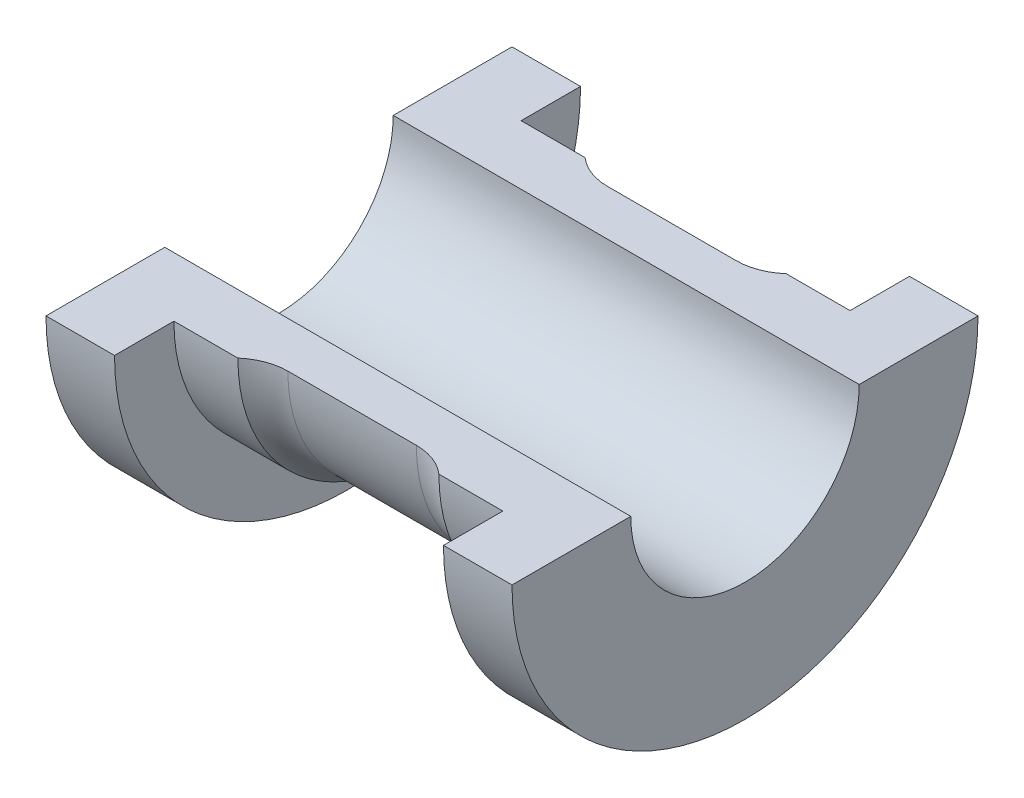
ISO-10303-21;
HEADER;
FILE_DESCRIPTION(('STEP AP214'),'2;1');
FILE_NAME('part.step','',(''),(''),'','','');
FILE_SCHEMA(('AUTOMOTIVE_DESIGN { 1 0 10303 214 1 1 1 1 }'));
ENDSEC;
DATA;
#1=APPLICATION_CONTEXT('core data for automotive mechanical design processes');
#2=APPLICATION_PROTOCOL_DEFINITION('international standard','automotive_design',2000,#1);
#3=PRODUCT_CONTEXT('',#1,'mechanical');
#4=PRODUCT('Part','Part','',(#3));
#5=PRODUCT_RELATED_PRODUCT_CATEGORY('part','',(#4));
#6=PRODUCT_DEFINITION_FORMATION('','',#4);
#7=PRODUCT_DEFINITION_CONTEXT('part definition',#1,'design');
#8=PRODUCT_DEFINITION('design','',#6,#7);
#9=PRODUCT_DEFINITION_SHAPE('','',#8);
#10=(LENGTH_UNIT() NAMED_UNIT(*) SI_UNIT(.MILLI.,.METRE.));
#11=(NAMED_UNIT(*) PLANE_ANGLE_UNIT() SI_UNIT($,.RADIAN.));
#12=(NAMED_UNIT(*) SI_UNIT($,.STERADIAN.) SOLID_ANGLE_UNIT());
#13=UNCERTAINTY_MEASURE_WITH_UNIT(LENGTH_MEASURE(1.E-05),#10,'distance_accuracy_value','');
#14=(GEOMETRIC_REPRESENTATION_CONTEXT(3) GLOBAL_UNCERTAINTY_ASSIGNED_CONTEXT((#13)) GLOBAL_UNIT_ASSIGNED_CONTEXT((#10,
#11,#12)) REPRESENTATION_CONTEXT('',''));
#15=CARTESIAN_POINT('',(0.,0.,0.));
#16=DIRECTION('',(0.,0.,1.));
#17=DIRECTION('',(1.,0.,0.));
#18=AXIS2_PLACEMENT_3D('',#15,#16,#17);
#19=CARTESIAN_POINT('',(25.5,0.,-12.5));
#20=DIRECTION('',(1.,0.,0.));
#21=DIRECTION('',(0.,0.,-1.));
#22=AXIS2_PLACEMENT_3D('',#19,#20,#21);
#23=PLANE('',#22);
#24=CARTESIAN_POINT('',(25.5,0.,0.));
#25=DIRECTION('',(-1.,0.,0.));
#26=DIRECTION('',(0.,0.,1.));
#27=AXIS2_PLACEMENT_3D('',#24,#25,#26);
#28=CIRCLE('',#27,25.5);
#29=CARTESIAN_POINT('',(25.5,0.,-25.5));
#30=VERTEX_POINT('',#29);
#31=CARTESIAN_POINT('',(25.5,0.,25.5));
#32=VERTEX_POINT('',#31);
#33=EDGE_CURVE('E228',#30,#32,#28,.T.);
#34=ORIENTED_EDGE('',*,*,#33,.F.);
#35=DIRECTION('',(0.,0.,1.));
#36=VECTOR('',#35,1.);
#37=CARTESIAN_POINT('',(25.5,0.,-12.5));
#38=LINE('',#37,#36);
#39=CARTESIAN_POINT('',(25.5,0.,-12.5));
#40=VERTEX_POINT('',#39);
#41=EDGE_CURVE('E138',#30,#40,#38,.T.);
#42=ORIENTED_EDGE('',*,*,#41,.T.);
#43=CARTESIAN_POINT('',(25.5,0.,0.));
#44=DIRECTION('',(-1.,0.,0.));
#45=DIRECTION('',(0.,0.,1.));
#46=AXIS2_PLACEMENT_3D('',#43,#44,#45);
#47=CIRCLE('',#46,12.5);
#48=CARTESIAN_POINT('',(25.5,0.,12.5));
#49=VERTEX_POINT('',#48);
#50=EDGE_CURVE('E133',#40,#49,#47,.T.);
#51=ORIENTED_EDGE('',*,*,#50,.T.);
#52=DIRECTION('',(0.,0.,-1.));
#53=VECTOR('',#52,1.);
#54=CARTESIAN_POINT('',(25.5,0.,12.5));
#55=LINE('',#54,#53);
#56=EDGE_CURVE('E136',#32,#49,#55,.T.);
#57=ORIENTED_EDGE('',*,*,#56,.F.);
#58=EDGE_LOOP('',(#34,#42,#51,#57));
#59=FACE_BOUND('',#58,.T.);
#60=ADVANCED_FACE('F38',(#59),#23,.T.);
#61=CARTESIAN_POINT('',(0.,0.,0.));
#62=DIRECTION('',(-1.,0.,0.));
#63=DIRECTION('',(0.,0.,1.));
#64=AXIS2_PLACEMENT_3D('',#61,#62,#63);
#65=CYLINDRICAL_SURFACE('',#64,25.5);
#66=CARTESIAN_POINT('',(18.,0.,0.));
#67=DIRECTION('',(-1.,0.,0.));
#68=DIRECTION('',(0.,0.,1.));
#69=AXIS2_PLACEMENT_3D('',#66,#67,#68);
#70=CIRCLE('',#69,25.5);
#71=CARTESIAN_POINT('',(18.,0.,-25.5));
#72=VERTEX_POINT('',#71);
#73=CARTESIAN_POINT('',(18.,0.,25.5));
#74=VERTEX_POINT('',#73);
#75=EDGE_CURVE('E226',#72,#74,#70,.T.);
#76=ORIENTED_EDGE('',*,*,#75,.F.);
#77=DIRECTION('',(1.,0.,0.));
#78=VECTOR('',#77,1.);
#79=CARTESIAN_POINT('',(25.5,0.,-25.5));
#80=LINE('',#79,#78);
#81=EDGE_CURVE('E143',#72,#30,#80,.T.);
#82=ORIENTED_EDGE('',*,*,#81,.T.);
#83=ORIENTED_EDGE('',*,*,#33,.T.);
#84=DIRECTION('',(1.,0.,0.));
#85=VECTOR('',#84,1.);
#86=CARTESIAN_POINT('',(25.5,0.,25.5));
#87=LINE('',#86,#85);
#88=EDGE_CURVE('E157',#74,#32,#87,.T.);
#89=ORIENTED_EDGE('',*,*,#88,.F.);
#90=EDGE_LOOP('',(#76,#82,#83,#89));
#91=FACE_BOUND('',#90,.T.);
#92=ADVANCED_FACE('F281',(#91),#65,.T.);
#93=CARTESIAN_POINT('',(18.,0.,-25.5));
#94=DIRECTION('',(-1.,0.,0.));
#95=DIRECTION('',(0.,0.,1.));
#96=AXIS2_PLACEMENT_3D('',#93,#94,#95);
#97=PLANE('',#96);
#98=CARTESIAN_POINT('',(18.,0.,0.));
#99=DIRECTION('',(-1.,0.,0.));
#100=DIRECTION('',(0.,0.,1.));
#101=AXIS2_PLACEMENT_3D('',#98,#99,#100);
#102=CIRCLE('',#101,19.);
#103=CARTESIAN_POINT('',(18.,0.,-19.));
#104=VERTEX_POINT('',#103);
#105=CARTESIAN_POINT('',(18.,0.,19.));
#106=VERTEX_POINT('',#105);
#107=EDGE_CURVE('E224',#104,#106,#102,.T.);
#108=ORIENTED_EDGE('',*,*,#107,.F.);
#109=DIRECTION('',(0.,0.,-1.));
#110=VECTOR('',#109,1.);
#111=CARTESIAN_POINT('',(18.,0.,-25.5));
#112=LINE('',#111,#110);
#113=EDGE_CURVE('E207',#104,#72,#112,.T.);
#114=ORIENTED_EDGE('',*,*,#113,.T.);
#115=ORIENTED_EDGE('',*,*,#75,.T.);
#116=DIRECTION('',(0.,0.,1.));
#117=VECTOR('',#116,1.);
#118=CARTESIAN_POINT('',(18.,0.,25.5));
#119=LINE('',#118,#117);
#120=EDGE_CURVE('E184',#106,#74,#119,.T.);
#121=ORIENTED_EDGE('',*,*,#120,.F.);
#122=EDGE_LOOP('',(#108,#114,#115,#121));
#123=FACE_BOUND('',#122,.T.);
#124=ADVANCED_FACE('F305',(#123),#97,.T.);
#125=CARTESIAN_POINT('',(0.,0.,0.));
#126=DIRECTION('',(-1.,0.,0.));
#127=DIRECTION('',(0.,0.,1.));
#128=AXIS2_PLACEMENT_3D('',#125,#126,#127);
#129=CYLINDRICAL_SURFACE('',#128,19.);
#130=CARTESIAN_POINT('',(11.,0.,0.));
#131=DIRECTION('',(-1.,0.,0.));
#132=DIRECTION('',(0.,0.,1.));
#133=AXIS2_PLACEMENT_3D('',#130,#131,#132);
#134=CIRCLE('',#133,19.);
#135=CARTESIAN_POINT('',(11.,0.,-19.));
#136=VERTEX_POINT('',#135);
#137=CARTESIAN_POINT('',(11.,0.,19.));
#138=VERTEX_POINT('',#137);
#139=EDGE_CURVE('E222',#136,#138,#134,.T.);
#140=ORIENTED_EDGE('',*,*,#139,.F.);
#141=DIRECTION('',(1.,0.,0.));
#142=VECTOR('',#141,1.);
#143=CARTESIAN_POINT('',(18.,0.,-19.));
#144=LINE('',#143,#142);
#145=EDGE_CURVE('E204',#136,#104,#144,.T.);
#146=ORIENTED_EDGE('',*,*,#145,.T.);
#147=ORIENTED_EDGE('',*,*,#107,.T.);
#148=DIRECTION('',(1.,0.,0.));
#149=VECTOR('',#148,1.);
#150=CARTESIAN_POINT('',(18.,0.,19.));
#151=LINE('',#150,#149);
#152=EDGE_CURVE('E181',#138,#106,#151,.T.);
#153=ORIENTED_EDGE('',*,*,#152,.F.);
#154=EDGE_LOOP('',(#140,#146,#147,#153));
#155=FACE_BOUND('',#154,.T.);
#156=ADVANCED_FACE('F302',(#155),#129,.T.);
#157=CARTESIAN_POINT('',(0.,0.,0.));
#158=DIRECTION('',(-1.,0.,0.));
#159=DIRECTION('',(0.,0.,1.));
#160=AXIS2_PLACEMENT_3D('',#157,#158,#159);
#161=CYLINDRICAL_SURFACE('',#160,17.5);
#162=CARTESIAN_POINT('',(0.,-17.2434862639043,2.98532769835149));
#163=CARTESIAN_POINT('',(-0.393250882339953,-17.243440773825,2.98559045260708));
#164=CARTESIAN_POINT('',(-0.781759878769831,-17.2571008429659,2.90950813706837));
#165=CARTESIAN_POINT('',(-1.51107048707411,-17.3047039270095,2.61151088500578));
#166=CARTESIAN_POINT('',(-1.83907500387849,-17.3374866995494,2.39593028346868));
#167=CARTESIAN_POINT('',(-2.40153121476436,-17.405459733898,1.83817801965744));
#168=CARTESIAN_POINT('',(-2.61999696779297,-17.4383946077781,1.51157635160106));
#169=CARTESIAN_POINT('',(-2.92216648753775,-17.4861631645158,0.785218025286078));
#170=CARTESIAN_POINT('',(-2.99978309080482,-17.4999747284957,0.394490958287499));
#171=CARTESIAN_POINT('',(-3.00020313103648,-17.5000251994827,-0.392245626652773));
#172=CARTESIAN_POINT('',(-2.92233201422487,-17.486193526505,-0.784102774258267));
#173=CARTESIAN_POINT('',(-2.62165153743178,-17.4386345936814,-1.50857704975354));
#174=CARTESIAN_POINT('',(-2.40032413043852,-17.4053220941187,-1.83909902079286));
#175=CARTESIAN_POINT('',(-1.84342457074351,-17.3380065042362,-2.39187225147226));
#176=CARTESIAN_POINT('',(-1.51348120573668,-17.304870661263,-2.61042075398936));
#177=CARTESIAN_POINT('',(-0.784003911550635,-17.2572004955913,-2.90893041698523));
#178=CARTESIAN_POINT('',(-0.395104830969666,-17.2435181087001,-2.98514375608326));
#179=CARTESIAN_POINT('',(0.39361317541351,-17.2434847658635,-2.98533635273879));
#180=CARTESIAN_POINT('',(0.783376866371704,-17.2571907578095,-2.90895717093623));
#181=CARTESIAN_POINT('',(1.51138134053941,-17.3046829255838,-2.61163043303931));
#182=CARTESIAN_POINT('',(1.84278628919265,-17.3379189203298,-2.3924443407595));
#183=CARTESIAN_POINT('',(2.39890969851227,-17.4051393722659,-1.84074600191357));
#184=CARTESIAN_POINT('',(2.62104876152191,-17.4385085787922,-1.51005136749368));
#185=CARTESIAN_POINT('',(2.92175382111394,-17.4861356033459,-0.785428702349688));
#186=CARTESIAN_POINT('',(2.99998595384844,-17.4999912256025,-0.394447010605972));
#187=CARTESIAN_POINT('',(2.99986469458534,-17.5000087657294,0.393668057799221));
#188=CARTESIAN_POINT('',(2.92275700456279,-17.4862869021835,0.78289098855791));
#189=CARTESIAN_POINT('',(2.62049196207681,-17.4384544262522,1.51111056808));
#190=CARTESIAN_POINT('',(2.40026616181748,-17.405349140116,1.83894587826154));
#191=CARTESIAN_POINT('',(1.84233397033925,-17.3378529736491,2.39306391403182));
#192=CARTESIAN_POINT('',(1.511770269646,-17.3047473511076,2.61121309357107));
#193=CARTESIAN_POINT('',(0.784438179950222,-17.2572071508141,2.90886851878743));
#194=CARTESIAN_POINT('',(0.393250882339953,-17.2435317539836,2.98506494409589));
#195=CARTESIAN_POINT('',(0.,-17.2434862639043,2.98532769835149));
#196=B_SPLINE_CURVE_WITH_KNOTS('',3,(#162,#163,#164,#165,#166,#167,#168,#169,#170,#171,#172,
#173,#174,#175,#176,#177,#178,#179,#180,#181,#182,#183,#184,#185,#186,#187,#188,#189,#190,#191,
#192,#193,#194,#195),.UNSPECIFIED.,.T.,.F.,(4,2,2,2,2,2,2,2,2,2,2,2,2,2,2,2,4),(0.,0.0625,0.125,
0.1875,0.25,0.3125,0.375,0.4375,0.5,0.5625,0.625,0.6875,0.75,0.8125,0.875,0.9375,1.),.UNSPECIFIED.);
#197=CARTESIAN_POINT('',(0.,-17.2434862639043,2.98532769835149));
#198=VERTEX_POINT('',#197);
#199=EDGE_CURVE('E12',#198,#198,#196,.T.);
#200=ORIENTED_EDGE('',*,*,#199,.F.);
#201=EDGE_LOOP('',(#200));
#202=FACE_BOUND('',#201,.T.);
#203=DIRECTION('',(1.,0.,0.));
#204=VECTOR('',#203,1.);
#205=CARTESIAN_POINT('',(11.,0.,-17.5));
#206=LINE('',#205,#204);
#207=CARTESIAN_POINT('',(-7.03137303340311,0.,-17.5));
#208=VERTEX_POINT('',#207);
#209=CARTESIAN_POINT('',(7.03137303340311,0.,-17.5));
#210=VERTEX_POINT('',#209);
#211=EDGE_CURVE('E202',#208,#210,#206,.T.);
#212=ORIENTED_EDGE('',*,*,#211,.T.);
#213=CARTESIAN_POINT('',(7.03137303340311,0.,0.));
#214=DIRECTION('',(1.,0.,0.));
#215=DIRECTION('',(0.,0.,-1.));
#216=AXIS2_PLACEMENT_3D('',#213,#214,#215);
#217=CIRCLE('',#216,17.5);
#218=CARTESIAN_POINT('',(7.03137303340311,0.,17.5));
#219=VERTEX_POINT('',#218);
#220=EDGE_CURVE('E236',#210,#219,#217,.F.);
#221=ORIENTED_EDGE('',*,*,#220,.T.);
#222=DIRECTION('',(1.,0.,0.));
#223=VECTOR('',#222,1.);
#224=CARTESIAN_POINT('',(11.,0.,17.5));
#225=LINE('',#224,#223);
#226=CARTESIAN_POINT('',(-7.03137303340311,0.,17.5));
#227=VERTEX_POINT('',#226);
#228=EDGE_CURVE('E178',#227,#219,#225,.T.);
#229=ORIENTED_EDGE('',*,*,#228,.F.);
#230=CARTESIAN_POINT('',(-7.03137303340311,0.,0.));
#231=DIRECTION('',(-1.,0.,0.));
#232=DIRECTION('',(0.,0.,1.));
#233=AXIS2_PLACEMENT_3D('',#230,#231,#232);
#234=CIRCLE('',#233,17.5);
#235=EDGE_CURVE('E230',#227,#208,#234,.F.);
#236=ORIENTED_EDGE('',*,*,#235,.T.);
#237=EDGE_LOOP('',(#212,#221,#229,#236));
#238=FACE_BOUND('',#237,.T.);
#239=ADVANCED_FACE('F241',(#202,#238),#161,.T.);
#240=CARTESIAN_POINT('',(0.,0.,0.));
#241=DIRECTION('',(-1.,0.,0.));
#242=DIRECTION('',(0.,0.,1.));
#243=AXIS2_PLACEMENT_3D('',#240,#241,#242);
#244=CYLINDRICAL_SURFACE('',#243,19.);
#245=CARTESIAN_POINT('',(-18.,0.,0.));
#246=DIRECTION('',(-1.,0.,0.));
#247=DIRECTION('',(0.,0.,1.));
#248=AXIS2_PLACEMENT_3D('',#245,#246,#247);
#249=CIRCLE('',#248,19.);
#250=CARTESIAN_POINT('',(-18.,0.,-19.));
#251=VERTEX_POINT('',#250);
#252=CARTESIAN_POINT('',(-18.,0.,19.));
#253=VERTEX_POINT('',#252);
#254=EDGE_CURVE('E217',#251,#253,#249,.T.);
#255=ORIENTED_EDGE('',*,*,#254,.F.);
#256=DIRECTION('',(1.,0.,0.));
#257=VECTOR('',#256,1.);
#258=CARTESIAN_POINT('',(-18.,0.,-19.));
#259=LINE('',#258,#257);
#260=CARTESIAN_POINT('',(-11.,0.,-19.));
#261=VERTEX_POINT('',#260);
#262=EDGE_CURVE('E199',#251,#261,#259,.T.);
#263=ORIENTED_EDGE('',*,*,#262,.T.);
#264=CARTESIAN_POINT('',(-11.,0.,0.));
#265=DIRECTION('',(-1.,0.,0.));
#266=DIRECTION('',(0.,0.,1.));
#267=AXIS2_PLACEMENT_3D('',#264,#265,#266);
#268=CIRCLE('',#267,19.);
#269=CARTESIAN_POINT('',(-11.,0.,19.));
#270=VERTEX_POINT('',#269);
#271=EDGE_CURVE('E219',#261,#270,#268,.T.);
#272=ORIENTED_EDGE('',*,*,#271,.T.);
#273=DIRECTION('',(1.,0.,0.));
#274=VECTOR('',#273,1.);
#275=CARTESIAN_POINT('',(-18.,0.,19.));
#276=LINE('',#275,#274);
#277=EDGE_CURVE('E175',#253,#270,#276,.T.);
#278=ORIENTED_EDGE('',*,*,#277,.F.);
#279=EDGE_LOOP('',(#255,#263,#272,#278));
#280=FACE_BOUND('',#279,.T.);
#281=ADVANCED_FACE('F295',(#280),#244,.T.);
#282=CARTESIAN_POINT('',(-18.,0.,-25.5));
#283=DIRECTION('',(1.,0.,0.));
#284=DIRECTION('',(0.,0.,-1.));
#285=AXIS2_PLACEMENT_3D('',#282,#283,#284);
#286=PLANE('',#285);
#287=CARTESIAN_POINT('',(-18.,0.,0.));
#288=DIRECTION('',(-1.,0.,0.));
#289=DIRECTION('',(0.,0.,1.));
#290=AXIS2_PLACEMENT_3D('',#287,#288,#289);
#291=CIRCLE('',#290,25.5);
#292=CARTESIAN_POINT('',(-18.,0.,-25.5));
#293=VERTEX_POINT('',#292);
#294=CARTESIAN_POINT('',(-18.,0.,25.5));
#295=VERTEX_POINT('',#294);
#296=EDGE_CURVE('E215',#293,#295,#291,.T.);
#297=ORIENTED_EDGE('',*,*,#296,.F.);
#298=DIRECTION('',(0.,0.,1.));
#299=VECTOR('',#298,1.);
#300=CARTESIAN_POINT('',(-18.,0.,-25.5));
#301=LINE('',#300,#299);
#302=EDGE_CURVE('E196',#293,#251,#301,.T.);
#303=ORIENTED_EDGE('',*,*,#302,.T.);
#304=ORIENTED_EDGE('',*,*,#254,.T.);
#305=DIRECTION('',(0.,0.,-1.));
#306=VECTOR('',#305,1.);
#307=CARTESIAN_POINT('',(-18.,0.,25.5));
#308=LINE('',#307,#306);
#309=EDGE_CURVE('E172',#295,#253,#308,.T.);
#310=ORIENTED_EDGE('',*,*,#309,.F.);
#311=EDGE_LOOP('',(#297,#303,#304,#310));
#312=FACE_BOUND('',#311,.T.);
#313=ADVANCED_FACE('F291',(#312),#286,.T.);
#314=CARTESIAN_POINT('',(0.,0.,0.));
#315=DIRECTION('',(-1.,0.,0.));
#316=DIRECTION('',(0.,0.,1.));
#317=AXIS2_PLACEMENT_3D('',#314,#315,#316);
#318=CYLINDRICAL_SURFACE('',#317,25.5);
#319=CARTESIAN_POINT('',(-25.5,0.,0.));
#320=DIRECTION('',(-1.,0.,0.));
#321=DIRECTION('',(0.,0.,1.));
#322=AXIS2_PLACEMENT_3D('',#319,#320,#321);
#323=CIRCLE('',#322,25.5);
#324=CARTESIAN_POINT('',(-25.5,0.,-25.5));
#325=VERTEX_POINT('',#324);
#326=CARTESIAN_POINT('',(-25.5,0.,25.5));
#327=VERTEX_POINT('',#326);
#328=EDGE_CURVE('E213',#325,#327,#323,.T.);
#329=ORIENTED_EDGE('',*,*,#328,.F.);
#330=DIRECTION('',(1.,0.,0.));
#331=VECTOR('',#330,1.);
#332=CARTESIAN_POINT('',(-25.5,0.,-25.5));
#333=LINE('',#332,#331);
#334=EDGE_CURVE('E193',#325,#293,#333,.T.);
#335=ORIENTED_EDGE('',*,*,#334,.T.);
#336=ORIENTED_EDGE('',*,*,#296,.T.);
#337=DIRECTION('',(1.,0.,0.));
#338=VECTOR('',#337,1.);
#339=CARTESIAN_POINT('',(-25.5,0.,25.5));
#340=LINE('',#339,#338);
#341=EDGE_CURVE('E169',#327,#295,#340,.T.);
#342=ORIENTED_EDGE('',*,*,#341,.F.);
#343=EDGE_LOOP('',(#329,#335,#336,#342));
#344=FACE_BOUND('',#343,.T.);
#345=ADVANCED_FACE('F287',(#344),#318,.T.);
#346=CARTESIAN_POINT('',(-25.5,0.,-12.5));
#347=DIRECTION('',(-1.,0.,0.));
#348=DIRECTION('',(0.,0.,1.));
#349=AXIS2_PLACEMENT_3D('',#346,#347,#348);
#350=PLANE('',#349);
#351=CARTESIAN_POINT('',(-25.5,0.,0.));
#352=DIRECTION('',(-1.,0.,0.));
#353=DIRECTION('',(0.,0.,1.));
#354=AXIS2_PLACEMENT_3D('',#351,#352,#353);
#355=CIRCLE('',#354,12.5);
#356=CARTESIAN_POINT('',(-25.5,0.,-12.5));
#357=VERTEX_POINT('',#356);
#358=CARTESIAN_POINT('',(-25.5,0.,12.5));
#359=VERTEX_POINT('',#358);
#360=EDGE_CURVE('E142',#357,#359,#355,.T.);
#361=ORIENTED_EDGE('',*,*,#360,.F.);
#362=DIRECTION('',(0.,0.,-1.));
#363=VECTOR('',#362,1.);
#364=CARTESIAN_POINT('',(-25.5,0.,-12.5));
#365=LINE('',#364,#363);
#366=EDGE_CURVE('E190',#357,#325,#365,.T.);
#367=ORIENTED_EDGE('',*,*,#366,.T.);
#368=ORIENTED_EDGE('',*,*,#328,.T.);
#369=DIRECTION('',(0.,0.,1.));
#370=VECTOR('',#369,1.);
#371=CARTESIAN_POINT('',(-25.5,0.,12.5));
#372=LINE('',#371,#370);
#373=EDGE_CURVE('E151',#359,#327,#372,.T.);
#374=ORIENTED_EDGE('',*,*,#373,.F.);
#375=EDGE_LOOP('',(#361,#367,#368,#374));
#376=FACE_BOUND('',#375,.T.);
#377=ADVANCED_FACE('F284',(#376),#350,.T.);
#378=CARTESIAN_POINT('',(0.,0.,0.));
#379=DIRECTION('',(-1.,0.,0.));
#380=DIRECTION('',(0.,0.,1.));
#381=AXIS2_PLACEMENT_3D('',#378,#379,#380);
#382=CYLINDRICAL_SURFACE('',#381,12.5);
#383=DIRECTION('',(-1.,0.,0.));
#384=VECTOR('',#383,1.);
#385=CARTESIAN_POINT('',(-25.5,0.,-12.5));
#386=LINE('',#385,#384);
#387=EDGE_CURVE('E188',#40,#357,#386,.T.);
#388=ORIENTED_EDGE('',*,*,#387,.T.);
#389=ORIENTED_EDGE('',*,*,#360,.T.);
#390=DIRECTION('',(-1.,0.,0.));
#391=VECTOR('',#390,1.);
#392=CARTESIAN_POINT('',(-25.5,0.,12.5));
#393=LINE('',#392,#391);
#394=EDGE_CURVE('E146',#49,#359,#393,.T.);
#395=ORIENTED_EDGE('',*,*,#394,.F.);
#396=ORIENTED_EDGE('',*,*,#50,.F.);
#397=EDGE_LOOP('',(#388,#389,#395,#396));
#398=FACE_BOUND('',#397,.T.);
#399=ADVANCED_FACE('F147',(#398),#382,.F.);
#400=CARTESIAN_POINT('',(0.,0.,0.));
#401=DIRECTION('',(0.,1.,0.));
#402=DIRECTION('',(-1.,0.,0.));
#403=AXIS2_PLACEMENT_3D('',#400,#401,#402);
#404=PLANE('',#403);
#405=ORIENTED_EDGE('',*,*,#41,.F.);
#406=ORIENTED_EDGE('',*,*,#81,.F.);
#407=ORIENTED_EDGE('',*,*,#113,.F.);
#408=ORIENTED_EDGE('',*,*,#145,.F.);
#409=CARTESIAN_POINT('',(7.03137303340311,0.,-23.5));
#410=DIRECTION('',(0.,1.,0.));
#411=DIRECTION('',(0.,0.,1.));
#412=AXIS2_PLACEMENT_3D('',#409,#410,#411);
#413=CIRCLE('',#412,6.);
#414=EDGE_CURVE('E50',#136,#210,#413,.F.);
#415=ORIENTED_EDGE('',*,*,#414,.T.);
#416=ORIENTED_EDGE('',*,*,#211,.F.);
#417=CARTESIAN_POINT('',(-7.03137303340311,0.,-23.5));
#418=DIRECTION('',(0.,1.,0.));
#419=DIRECTION('',(0.,0.,1.));
#420=AXIS2_PLACEMENT_3D('',#417,#418,#419);
#421=CIRCLE('',#420,6.);
#422=EDGE_CURVE('E234',#208,#261,#421,.F.);
#423=ORIENTED_EDGE('',*,*,#422,.T.);
#424=ORIENTED_EDGE('',*,*,#262,.F.);
#425=ORIENTED_EDGE('',*,*,#302,.F.);
#426=ORIENTED_EDGE('',*,*,#334,.F.);
#427=ORIENTED_EDGE('',*,*,#366,.F.);
#428=ORIENTED_EDGE('',*,*,#387,.F.);
#429=EDGE_LOOP('',(#405,#406,#407,#408,#415,#416,#423,#424,#425,#426,#427,#428));
#430=FACE_BOUND('',#429,.T.);
#431=ADVANCED_FACE('F276',(#430),#404,.T.);
#432=CARTESIAN_POINT('',(0.,0.,0.));
#433=DIRECTION('',(0.,-1.,0.));
#434=DIRECTION('',(-1.,0.,0.));
#435=AXIS2_PLACEMENT_3D('',#432,#433,#434);
#436=PLANE('',#435);
#437=ORIENTED_EDGE('',*,*,#56,.T.);
#438=ORIENTED_EDGE('',*,*,#394,.T.);
#439=ORIENTED_EDGE('',*,*,#373,.T.);
#440=ORIENTED_EDGE('',*,*,#341,.T.);
#441=ORIENTED_EDGE('',*,*,#309,.T.);
#442=ORIENTED_EDGE('',*,*,#277,.T.);
#443=CARTESIAN_POINT('',(-7.03137303340311,0.,23.5));
#444=DIRECTION('',(0.,-1.,0.));
#445=DIRECTION('',(0.,0.,-1.));
#446=AXIS2_PLACEMENT_3D('',#443,#444,#445);
#447=CIRCLE('',#446,6.);
#448=EDGE_CURVE('E232',#270,#227,#447,.T.);
#449=ORIENTED_EDGE('',*,*,#448,.T.);
#450=ORIENTED_EDGE('',*,*,#228,.T.);
#451=CARTESIAN_POINT('',(7.03137303340311,0.,23.5));
#452=DIRECTION('',(0.,-1.,0.));
#453=DIRECTION('',(0.,0.,-1.));
#454=AXIS2_PLACEMENT_3D('',#451,#452,#453);
#455=CIRCLE('',#454,6.);
#456=EDGE_CURVE('E64',#219,#138,#455,.T.);
#457=ORIENTED_EDGE('',*,*,#456,.T.);
#458=ORIENTED_EDGE('',*,*,#152,.T.);
#459=ORIENTED_EDGE('',*,*,#120,.T.);
#460=ORIENTED_EDGE('',*,*,#88,.T.);
#461=EDGE_LOOP('',(#437,#438,#439,#440,#441,#442,#449,#450,#457,#458,#459,#460));
#462=FACE_BOUND('',#461,.T.);
#463=ADVANCED_FACE('F154',(#462),#436,.F.);
#464=CARTESIAN_POINT('',(-7.03137303340311,0.,0.));
#465=DIRECTION('',(-1.,0.,0.));
#466=DIRECTION('',(0.,0.,1.));
#467=AXIS2_PLACEMENT_3D('',#464,#465,#466);
#468=TOROIDAL_SURFACE('',#467,23.5,6.);
#469=ORIENTED_EDGE('',*,*,#422,.F.);
#470=ORIENTED_EDGE('',*,*,#235,.F.);
#471=ORIENTED_EDGE('',*,*,#448,.F.);
#472=ORIENTED_EDGE('',*,*,#271,.F.);
#473=EDGE_LOOP('',(#469,#470,#471,#472));
#474=FACE_BOUND('',#473,.T.);
#475=ADVANCED_FACE('F275',(#474),#468,.F.);
#476=CARTESIAN_POINT('',(7.03137303340311,0.,0.));
#477=DIRECTION('',(1.,0.,0.));
#478=DIRECTION('',(0.,0.,-1.));
#479=AXIS2_PLACEMENT_3D('',#476,#477,#478);
#480=TOROIDAL_SURFACE('',#479,23.5,6.);
#481=ORIENTED_EDGE('',*,*,#414,.F.);
#482=ORIENTED_EDGE('',*,*,#139,.T.);
#483=ORIENTED_EDGE('',*,*,#456,.F.);
#484=ORIENTED_EDGE('',*,*,#220,.F.);
#485=EDGE_LOOP('',(#481,#482,#483,#484));
#486=FACE_BOUND('',#485,.T.);
#487=ADVANCED_FACE('F40',(#486),#480,.F.);
#488=CARTESIAN_POINT('',(0.,-23.1555386972429,4.00886862350057));
#489=CARTESIAN_POINT('',(0.393250882339953,-23.1555997839208,4.00851578207163));
#490=CARTESIAN_POINT('',(0.784438179950222,-23.173963888236,3.90619486808598));
#491=CARTESIAN_POINT('',(1.511770269646,-23.237803585773,3.50648615422401));
#492=CARTESIAN_POINT('',(1.84233397033925,-23.2822597074716,3.2135429702713));
#493=CARTESIAN_POINT('',(2.40026616181748,-23.3728974167273,2.46944160795121));
#494=CARTESIAN_POINT('',(2.62049196207681,-23.4173530866815,2.02920561999314));
#495=CARTESIAN_POINT('',(2.92275700456279,-23.4815852686464,1.05131075606348));
#496=CARTESIAN_POINT('',(2.99986469458534,-23.5000117711224,0.528639963330383));
#497=CARTESIAN_POINT('',(2.99998595384844,-23.4999882172376,-0.529685985670876));
#498=CARTESIAN_POINT('',(2.92175382111394,-23.4813820959217,-1.0547185431553));
#499=CARTESIAN_POINT('',(2.62104876152191,-23.4174258058066,-2.02778326492009));
#500=CARTESIAN_POINT('',(2.39890969851227,-23.3726157284713,-2.47185891685536));
#501=CARTESIAN_POINT('',(1.84278628919265,-23.2823482644428,-3.21271097187705));
#502=CARTESIAN_POINT('',(1.51138134053941,-23.2377170714982,-3.50704658150993));
#503=CARTESIAN_POINT('',(0.783376866371704,-23.1739418747728,-3.90631391525722));
#504=CARTESIAN_POINT('',(0.39361317541351,-23.1555366855882,-4.00888024510637));
#505=CARTESIAN_POINT('',(-0.395104830969666,-23.1555814602544,-4.00862161531181));
#506=CARTESIAN_POINT('',(-0.784003911550635,-23.1739549512226,-3.90627798852303));
#507=CARTESIAN_POINT('',(-1.51348120573668,-23.237969173696,-3.50542215535714));
#508=CARTESIAN_POINT('',(-1.84342457074351,-23.2824658771172,-3.21194273769133));
#509=CARTESIAN_POINT('',(-2.40032413043852,-23.3728610978166,-2.46964725649327));
#510=CARTESIAN_POINT('',(-2.62165153743178,-23.4175950258008,-2.0258034668119));
#511=CARTESIAN_POINT('',(-2.92233201422487,-23.4814598784496,-1.05293801114682));
#512=CARTESIAN_POINT('',(-3.00020313103648,-23.5000338393053,-0.526729841505152));
#513=CARTESIAN_POINT('',(-2.99978309080482,-23.4999660639799,0.529745001128927));
#514=CARTESIAN_POINT('',(-2.92216648753775,-23.4814191066356,1.05443563395559));
#515=CARTESIAN_POINT('',(-2.61999696779297,-23.4172727590163,2.02983110072142));
#516=CARTESIAN_POINT('',(-2.40153121476436,-23.3730459283773,2.46841048354));
#517=CARTESIAN_POINT('',(-1.83907500387849,-23.2817678536807,3.21739209494366));
#518=CARTESIAN_POINT('',(-1.51107048707411,-23.2377452734128,3.50688604557919));
#519=CARTESIAN_POINT('',(-0.781759878769831,-23.1738211319828,3.90705378406324));
#520=CARTESIAN_POINT('',(-0.393250882339953,-23.155477610565,4.00922146492951));
#521=CARTESIAN_POINT('',(0.,-23.1555386972429,4.00886862350057));
#522=CARTESIAN_POINT('',(0.,-17.2434862639043,2.98532769835149));
#523=CARTESIAN_POINT('',(0.393250882339953,-17.2435317539836,2.98506494409589));
#524=CARTESIAN_POINT('',(0.784438179950222,-17.2572071508141,2.90886851878743));
#525=CARTESIAN_POINT('',(1.511770269646,-17.3047473511076,2.61121309357107));
#526=CARTESIAN_POINT('',(1.84233397033925,-17.3378529736491,2.39306391403182));
#527=CARTESIAN_POINT('',(2.40026616181748,-17.405349140116,1.83894587826154));
#528=CARTESIAN_POINT('',(2.62049196207681,-17.4384544262522,1.51111056808));
#529=CARTESIAN_POINT('',(2.92275700456279,-17.4862869021835,0.78289098855791));
#530=CARTESIAN_POINT('',(2.99986469458534,-17.5000087657294,0.393668057799221));
#531=CARTESIAN_POINT('',(2.99998595384844,-17.4999912256025,-0.394447010605972));
#532=CARTESIAN_POINT('',(2.92175382111394,-17.4861356033459,-0.785428702349688));
#533=CARTESIAN_POINT('',(2.62104876152191,-17.4385085787922,-1.51005136749368));
#534=CARTESIAN_POINT('',(2.39890969851227,-17.4051393722659,-1.84074600191357));
#535=CARTESIAN_POINT('',(1.84278628919265,-17.3379189203298,-2.3924443407595));
#536=CARTESIAN_POINT('',(1.51138134053941,-17.3046829255838,-2.61163043303931));
#537=CARTESIAN_POINT('',(0.783376866371704,-17.2571907578095,-2.90895717093623));
#538=CARTESIAN_POINT('',(0.39361317541351,-17.2434847658635,-2.98533635273879));
#539=CARTESIAN_POINT('',(-0.395104830969666,-17.2435181087001,-2.98514375608326));
#540=CARTESIAN_POINT('',(-0.784003911550635,-17.2572004955913,-2.90893041698523));
#541=CARTESIAN_POINT('',(-1.51348120573668,-17.304870661263,-2.61042075398936));
#542=CARTESIAN_POINT('',(-1.84342457074351,-17.3380065042362,-2.39187225147226));
#543=CARTESIAN_POINT('',(-2.40032413043852,-17.4053220941187,-1.83909902079286));
#544=CARTESIAN_POINT('',(-2.62165153743178,-17.4386345936814,-1.50857704975354));
#545=CARTESIAN_POINT('',(-2.92233201422487,-17.486193526505,-0.784102774258267));
#546=CARTESIAN_POINT('',(-3.00020313103648,-17.5000251994827,-0.392245626652773));
#547=CARTESIAN_POINT('',(-2.99978309080482,-17.4999747284957,0.394490958287499));
#548=CARTESIAN_POINT('',(-2.92216648753775,-17.4861631645158,0.785218025286078));
#549=CARTESIAN_POINT('',(-2.61999696779297,-17.4383946077781,1.51157635160106));
#550=CARTESIAN_POINT('',(-2.40153121476436,-17.405459733898,1.83817801965744));
#551=CARTESIAN_POINT('',(-1.83907500387849,-17.3374866995494,2.39593028346868));
#552=CARTESIAN_POINT('',(-1.51107048707411,-17.3047039270095,2.61151088500578));
#553=CARTESIAN_POINT('',(-0.781759878769831,-17.2571008429659,2.90950813706837));
#554=CARTESIAN_POINT('',(-0.393250882339953,-17.243440773825,2.98559045260708));
#555=CARTESIAN_POINT('',(0.,-17.2434862639043,2.98532769835149));
#556=B_SPLINE_SURFACE_WITH_KNOTS('',1,3,((#488,#489,#490,#491,#492,#493,#494,#495,#496,#497,
#498,#499,#500,#501,#502,#503,#504,#505,#506,#507,#508,#509,#510,#511,#512,#513,#514,#515,#516,
#517,#518,#519,#520,#521),(#522,#523,#524,#525,#526,#527,#528,#529,#530,#531,#532,#533,#534,
#535,#536,#537,#538,#539,#540,#541,#542,#543,#544,#545,#546,#547,#548,#549,#550,#551,#552,#553,
#554,#555)),.UNSPECIFIED.,.F.,.T.,.F.,(2,2),(4,2,2,2,2,2,2,2,2,2,2,2,2,2,2,2,4),(0.,1.),(0.,
0.0625,0.125,0.1875,0.25,0.3125,0.375,0.4375,0.5,0.5625,0.625,0.6875,0.75,0.8125,0.875,0.9375,
1.),.UNSPECIFIED.);
#557=CARTESIAN_POINT('',(0.,-23.1555386972429,4.00886862350057));
#558=CARTESIAN_POINT('',(0.393250882339953,-23.1555997839208,4.00851578207163));
#559=CARTESIAN_POINT('',(0.784438179950222,-23.173963888236,3.90619486808598));
#560=CARTESIAN_POINT('',(1.511770269646,-23.237803585773,3.50648615422401));
#561=CARTESIAN_POINT('',(1.84233397033925,-23.2822597074716,3.2135429702713));
#562=CARTESIAN_POINT('',(2.40026616181748,-23.3728974167273,2.46944160795121));
#563=CARTESIAN_POINT('',(2.62049196207681,-23.4173530866815,2.02920561999314));
#564=CARTESIAN_POINT('',(2.92275700456279,-23.4815852686464,1.05131075606348));
#565=CARTESIAN_POINT('',(2.99986469458534,-23.5000117711224,0.528639963330383));
#566=CARTESIAN_POINT('',(2.99998595384844,-23.4999882172376,-0.529685985670876));
#567=CARTESIAN_POINT('',(2.92175382111394,-23.4813820959217,-1.0547185431553));
#568=CARTESIAN_POINT('',(2.62104876152191,-23.4174258058066,-2.02778326492009));
#569=CARTESIAN_POINT('',(2.39890969851227,-23.3726157284713,-2.47185891685536));
#570=CARTESIAN_POINT('',(1.84278628919265,-23.2823482644428,-3.21271097187705));
#571=CARTESIAN_POINT('',(1.51138134053941,-23.2377170714982,-3.50704658150993));
#572=CARTESIAN_POINT('',(0.783376866371704,-23.1739418747728,-3.90631391525722));
#573=CARTESIAN_POINT('',(0.39361317541351,-23.1555366855882,-4.00888024510637));
#574=CARTESIAN_POINT('',(-0.395104830969666,-23.1555814602544,-4.00862161531181));
#575=CARTESIAN_POINT('',(-0.784003911550635,-23.1739549512226,-3.90627798852303));
#576=CARTESIAN_POINT('',(-1.51348120573668,-23.237969173696,-3.50542215535714));
#577=CARTESIAN_POINT('',(-1.84342457074351,-23.2824658771172,-3.21194273769133));
#578=CARTESIAN_POINT('',(-2.40032413043852,-23.3728610978166,-2.46964725649327));
#579=CARTESIAN_POINT('',(-2.62165153743178,-23.4175950258008,-2.0258034668119));
#580=CARTESIAN_POINT('',(-2.92233201422487,-23.4814598784496,-1.05293801114682));
#581=CARTESIAN_POINT('',(-3.00020313103648,-23.5000338393053,-0.526729841505152));
#582=CARTESIAN_POINT('',(-2.99978309080482,-23.4999660639799,0.529745001128927));
#583=CARTESIAN_POINT('',(-2.92216648753775,-23.4814191066356,1.05443563395559));
#584=CARTESIAN_POINT('',(-2.61999696779297,-23.4172727590163,2.02983110072142));
#585=CARTESIAN_POINT('',(-2.40153121476436,-23.3730459283773,2.46841048354));
#586=CARTESIAN_POINT('',(-1.83907500387849,-23.2817678536807,3.21739209494366));
#587=CARTESIAN_POINT('',(-1.51107048707411,-23.2377452734128,3.50688604557919));
#588=CARTESIAN_POINT('',(-0.781759878769831,-23.1738211319828,3.90705378406324));
#589=CARTESIAN_POINT('',(-0.393250882339953,-23.155477610565,4.00922146492951));
#590=CARTESIAN_POINT('',(0.,-23.1555386972429,4.00886862350057));
#591=B_SPLINE_CURVE_WITH_KNOTS('',3,(#557,#558,#559,#560,#561,#562,#563,#564,#565,#566,#567,
#568,#569,#570,#571,#572,#573,#574,#575,#576,#577,#578,#579,#580,#581,#582,#583,#584,#585,#586,
#587,#588,#589,#590),.UNSPECIFIED.,.T.,.F.,(4,2,2,2,2,2,2,2,2,2,2,2,2,2,2,2,4),(0.,0.0625,0.125,
0.1875,0.25,0.3125,0.375,0.4375,0.5,0.5625,0.625,0.6875,0.75,0.8125,0.875,0.9375,1.),.UNSPECIFIED.);
#592=CARTESIAN_POINT('',(0.,-23.1555386972429,4.00886862350057));
#593=VERTEX_POINT('',#592);
#594=EDGE_CURVE('E158',#593,#593,#591,.T.);
#595=ORIENTED_EDGE('',*,*,#199,.T.);
#596=EDGE_LOOP('',(#595));
#597=FACE_BOUND('',#596,.T.);
#598=ORIENTED_EDGE('',*,*,#594,.T.);
#599=EDGE_LOOP('',(#598));
#600=FACE_BOUND('',#599,.T.);
#601=ADVANCED_FACE('F245',(#597,#600),#556,.F.);
#602=CARTESIAN_POINT('',(0.,0.,0.));
#603=DIRECTION('',(-1.,0.,0.));
#604=DIRECTION('',(0.,0.,1.));
#605=AXIS2_PLACEMENT_3D('',#602,#603,#604);
#606=CYLINDRICAL_SURFACE('',#605,23.5);
#607=ORIENTED_EDGE('',*,*,#594,.F.);
#608=EDGE_LOOP('',(#607));
#609=FACE_BOUND('',#608,.T.);
#610=ADVANCED_FACE('F265',(#609),#606,.T.);
#611=CLOSED_SHELL('',(#60,#92,#124,#156,#239,#281,#313,#345,#377,#399,#431,#463,#475,#487,#601,#610));
#612=MANIFOLD_SOLID_BREP('B2',#611);
#613=ADVANCED_BREP_SHAPE_REPRESENTATION('',(#18,#612),#14);
#614=SHAPE_DEFINITION_REPRESENTATION(#9,#613);
ENDSEC;
END-ISO-10303-21;
